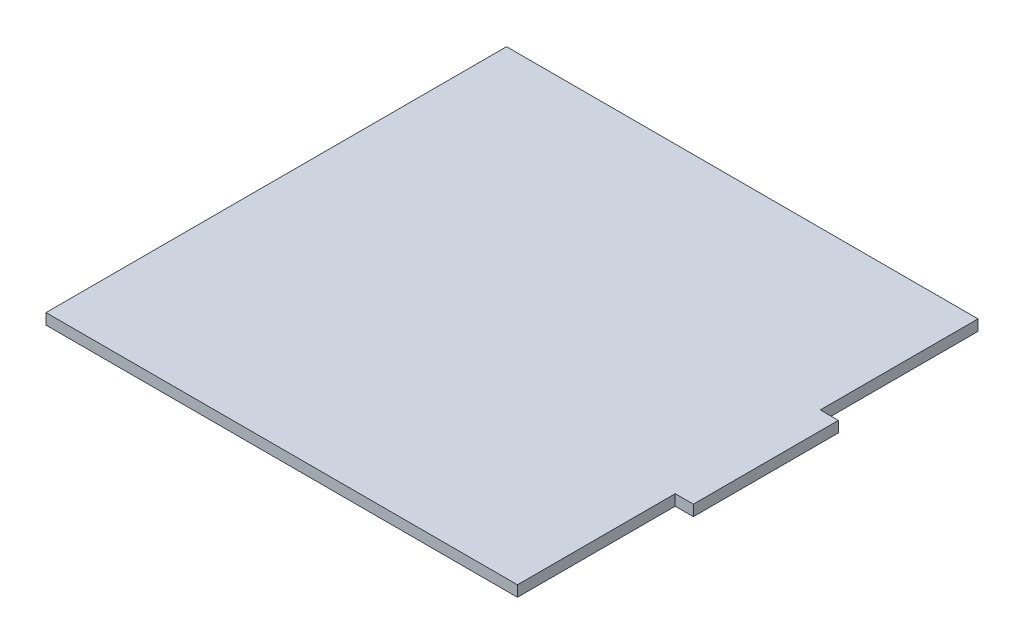
ISO-10303-21;
HEADER;
FILE_DESCRIPTION(('STEP AP214'),'2;1');
FILE_NAME('part.step','',(''),(''),'','','');
FILE_SCHEMA(('AUTOMOTIVE_DESIGN { 1 0 10303 214 1 1 1 1 }'));
ENDSEC;
DATA;
#1=APPLICATION_CONTEXT('core data for automotive mechanical design processes');
#2=APPLICATION_PROTOCOL_DEFINITION('international standard','automotive_design',2000,#1);
#3=PRODUCT_CONTEXT('',#1,'mechanical');
#4=PRODUCT('Part','Part','',(#3));
#5=PRODUCT_RELATED_PRODUCT_CATEGORY('part','',(#4));
#6=PRODUCT_DEFINITION_FORMATION('','',#4);
#7=PRODUCT_DEFINITION_CONTEXT('part definition',#1,'design');
#8=PRODUCT_DEFINITION('design','',#6,#7);
#9=PRODUCT_DEFINITION_SHAPE('','',#8);
#10=(LENGTH_UNIT() NAMED_UNIT(*) SI_UNIT(.MILLI.,.METRE.));
#11=(NAMED_UNIT(*) PLANE_ANGLE_UNIT() SI_UNIT($,.RADIAN.));
#12=(NAMED_UNIT(*) SI_UNIT($,.STERADIAN.) SOLID_ANGLE_UNIT());
#13=UNCERTAINTY_MEASURE_WITH_UNIT(LENGTH_MEASURE(1.E-05),#10,'distance_accuracy_value','');
#14=(GEOMETRIC_REPRESENTATION_CONTEXT(3) GLOBAL_UNCERTAINTY_ASSIGNED_CONTEXT((#13)) GLOBAL_UNIT_ASSIGNED_CONTEXT((#10,
#11,#12)) REPRESENTATION_CONTEXT('',''));
#15=CARTESIAN_POINT('',(0.,0.,0.));
#16=DIRECTION('',(0.,0.,1.));
#17=DIRECTION('',(1.,0.,0.));
#18=AXIS2_PLACEMENT_3D('',#15,#16,#17);
#19=CARTESIAN_POINT('',(65.,3.,20.));
#20=DIRECTION('',(-1.,0.,0.));
#21=DIRECTION('',(0.,0.,1.));
#22=AXIS2_PLACEMENT_3D('',#19,#20,#21);
#23=PLANE('',#22);
#24=DIRECTION('',(0.,0.,-1.));
#25=VECTOR('',#24,1.);
#26=CARTESIAN_POINT('',(65.,0.,20.));
#27=LINE('',#26,#25);
#28=CARTESIAN_POINT('',(65.,0.,63.5));
#29=VERTEX_POINT('',#28);
#30=CARTESIAN_POINT('',(65.,0.,20.));
#31=VERTEX_POINT('',#30);
#32=EDGE_CURVE('E140',#29,#31,#27,.T.);
#33=ORIENTED_EDGE('',*,*,#32,.T.);
#34=DIRECTION('',(0.,-1.,0.));
#35=VECTOR('',#34,1.);
#36=CARTESIAN_POINT('',(65.,3.,20.));
#37=LINE('',#36,#35);
#38=CARTESIAN_POINT('',(65.,3.,20.));
#39=VERTEX_POINT('',#38);
#40=EDGE_CURVE('E11',#39,#31,#37,.T.);
#41=ORIENTED_EDGE('',*,*,#40,.F.);
#42=DIRECTION('',(0.,0.,-1.));
#43=VECTOR('',#42,1.);
#44=CARTESIAN_POINT('',(65.,3.,20.));
#45=LINE('',#44,#43);
#46=CARTESIAN_POINT('',(65.,3.,63.5));
#47=VERTEX_POINT('',#46);
#48=EDGE_CURVE('E162',#47,#39,#45,.T.);
#49=ORIENTED_EDGE('',*,*,#48,.F.);
#50=DIRECTION('',(0.,-1.,0.));
#51=VECTOR('',#50,1.);
#52=CARTESIAN_POINT('',(65.,3.,63.5));
#53=LINE('',#52,#51);
#54=EDGE_CURVE('E136',#47,#29,#53,.T.);
#55=ORIENTED_EDGE('',*,*,#54,.T.);
#56=EDGE_LOOP('',(#33,#41,#49,#55));
#57=FACE_BOUND('',#56,.T.);
#58=ADVANCED_FACE('F39',(#57),#23,.F.);
#59=CARTESIAN_POINT('',(70.,3.,20.));
#60=DIRECTION('',(0.,0.,-1.));
#61=DIRECTION('',(-1.,0.,0.));
#62=AXIS2_PLACEMENT_3D('',#59,#60,#61);
#63=PLANE('',#62);
#64=DIRECTION('',(1.,0.,0.));
#65=VECTOR('',#64,1.);
#66=CARTESIAN_POINT('',(70.,0.,20.));
#67=LINE('',#66,#65);
#68=CARTESIAN_POINT('',(70.,0.,20.));
#69=VERTEX_POINT('',#68);
#70=EDGE_CURVE('E144',#31,#69,#67,.T.);
#71=ORIENTED_EDGE('',*,*,#70,.T.);
#72=DIRECTION('',(0.,-1.,0.));
#73=VECTOR('',#72,1.);
#74=CARTESIAN_POINT('',(70.,3.,20.));
#75=LINE('',#74,#73);
#76=CARTESIAN_POINT('',(70.,3.,20.));
#77=VERTEX_POINT('',#76);
#78=EDGE_CURVE('E48',#77,#69,#75,.T.);
#79=ORIENTED_EDGE('',*,*,#78,.F.);
#80=DIRECTION('',(1.,0.,0.));
#81=VECTOR('',#80,1.);
#82=CARTESIAN_POINT('',(70.,3.,20.));
#83=LINE('',#82,#81);
#84=EDGE_CURVE('E99',#39,#77,#83,.T.);
#85=ORIENTED_EDGE('',*,*,#84,.F.);
#86=ORIENTED_EDGE('',*,*,#40,.T.);
#87=EDGE_LOOP('',(#71,#79,#85,#86));
#88=FACE_BOUND('',#87,.T.);
#89=ADVANCED_FACE('F208',(#88),#63,.F.);
#90=CARTESIAN_POINT('',(70.,3.,-20.));
#91=DIRECTION('',(-1.,0.,0.));
#92=DIRECTION('',(0.,0.,1.));
#93=AXIS2_PLACEMENT_3D('',#90,#91,#92);
#94=PLANE('',#93);
#95=DIRECTION('',(0.,0.,-1.));
#96=VECTOR('',#95,1.);
#97=CARTESIAN_POINT('',(70.,0.,-20.));
#98=LINE('',#97,#96);
#99=CARTESIAN_POINT('',(70.,0.,-20.));
#100=VERTEX_POINT('',#99);
#101=EDGE_CURVE('E147',#69,#100,#98,.T.);
#102=ORIENTED_EDGE('',*,*,#101,.T.);
#103=DIRECTION('',(0.,-1.,0.));
#104=VECTOR('',#103,1.);
#105=CARTESIAN_POINT('',(70.,3.,-20.));
#106=LINE('',#105,#104);
#107=CARTESIAN_POINT('',(70.,3.,-20.));
#108=VERTEX_POINT('',#107);
#109=EDGE_CURVE('E173',#108,#100,#106,.T.);
#110=ORIENTED_EDGE('',*,*,#109,.F.);
#111=DIRECTION('',(0.,0.,-1.));
#112=VECTOR('',#111,1.);
#113=CARTESIAN_POINT('',(70.,3.,-20.));
#114=LINE('',#113,#112);
#115=EDGE_CURVE('E183',#77,#108,#114,.T.);
#116=ORIENTED_EDGE('',*,*,#115,.F.);
#117=ORIENTED_EDGE('',*,*,#78,.T.);
#118=EDGE_LOOP('',(#102,#110,#116,#117));
#119=FACE_BOUND('',#118,.T.);
#120=ADVANCED_FACE('F181',(#119),#94,.F.);
#121=CARTESIAN_POINT('',(65.,3.,-20.));
#122=DIRECTION('',(0.,0.,1.));
#123=DIRECTION('',(1.,0.,0.));
#124=AXIS2_PLACEMENT_3D('',#121,#122,#123);
#125=PLANE('',#124);
#126=DIRECTION('',(-1.,0.,0.));
#127=VECTOR('',#126,1.);
#128=CARTESIAN_POINT('',(65.,0.,-20.));
#129=LINE('',#128,#127);
#130=CARTESIAN_POINT('',(65.,0.,-20.));
#131=VERTEX_POINT('',#130);
#132=EDGE_CURVE('E150',#100,#131,#129,.T.);
#133=ORIENTED_EDGE('',*,*,#132,.T.);
#134=DIRECTION('',(0.,-1.,0.));
#135=VECTOR('',#134,1.);
#136=CARTESIAN_POINT('',(65.,3.,-20.));
#137=LINE('',#136,#135);
#138=CARTESIAN_POINT('',(65.,3.,-20.));
#139=VERTEX_POINT('',#138);
#140=EDGE_CURVE('E169',#139,#131,#137,.T.);
#141=ORIENTED_EDGE('',*,*,#140,.F.);
#142=DIRECTION('',(-1.,0.,0.));
#143=VECTOR('',#142,1.);
#144=CARTESIAN_POINT('',(65.,3.,-20.));
#145=LINE('',#144,#143);
#146=EDGE_CURVE('E196',#108,#139,#145,.T.);
#147=ORIENTED_EDGE('',*,*,#146,.F.);
#148=ORIENTED_EDGE('',*,*,#109,.T.);
#149=EDGE_LOOP('',(#133,#141,#147,#148));
#150=FACE_BOUND('',#149,.T.);
#151=ADVANCED_FACE('F191',(#150),#125,.F.);
#152=CARTESIAN_POINT('',(65.,3.,-63.5));
#153=DIRECTION('',(-1.,0.,0.));
#154=DIRECTION('',(0.,0.,1.));
#155=AXIS2_PLACEMENT_3D('',#152,#153,#154);
#156=PLANE('',#155);
#157=DIRECTION('',(0.,0.,-1.));
#158=VECTOR('',#157,1.);
#159=CARTESIAN_POINT('',(65.,0.,-63.5));
#160=LINE('',#159,#158);
#161=CARTESIAN_POINT('',(65.,0.,-63.5));
#162=VERTEX_POINT('',#161);
#163=EDGE_CURVE('E153',#131,#162,#160,.T.);
#164=ORIENTED_EDGE('',*,*,#163,.T.);
#165=DIRECTION('',(0.,-1.,0.));
#166=VECTOR('',#165,1.);
#167=CARTESIAN_POINT('',(65.,3.,-63.5));
#168=LINE('',#167,#166);
#169=CARTESIAN_POINT('',(65.,3.,-63.5));
#170=VERTEX_POINT('',#169);
#171=EDGE_CURVE('E129',#170,#162,#168,.T.);
#172=ORIENTED_EDGE('',*,*,#171,.F.);
#173=DIRECTION('',(0.,0.,-1.));
#174=VECTOR('',#173,1.);
#175=CARTESIAN_POINT('',(65.,3.,-63.5));
#176=LINE('',#175,#174);
#177=EDGE_CURVE('E118',#139,#170,#176,.T.);
#178=ORIENTED_EDGE('',*,*,#177,.F.);
#179=ORIENTED_EDGE('',*,*,#140,.T.);
#180=EDGE_LOOP('',(#164,#172,#178,#179));
#181=FACE_BOUND('',#180,.T.);
#182=ADVANCED_FACE('F194',(#181),#156,.F.);
#183=CARTESIAN_POINT('',(-65.,3.,-63.5));
#184=DIRECTION('',(0.,0.,1.));
#185=DIRECTION('',(1.,0.,0.));
#186=AXIS2_PLACEMENT_3D('',#183,#184,#185);
#187=PLANE('',#186);
#188=DIRECTION('',(-1.,0.,0.));
#189=VECTOR('',#188,1.);
#190=CARTESIAN_POINT('',(-65.,0.,-63.5));
#191=LINE('',#190,#189);
#192=CARTESIAN_POINT('',(-65.,0.,-63.5));
#193=VERTEX_POINT('',#192);
#194=EDGE_CURVE('E127',#162,#193,#191,.T.);
#195=ORIENTED_EDGE('',*,*,#194,.T.);
#196=DIRECTION('',(0.,-1.,0.));
#197=VECTOR('',#196,1.);
#198=CARTESIAN_POINT('',(-65.,3.,-63.5));
#199=LINE('',#198,#197);
#200=CARTESIAN_POINT('',(-65.,3.,-63.5));
#201=VERTEX_POINT('',#200);
#202=EDGE_CURVE('E124',#201,#193,#199,.T.);
#203=ORIENTED_EDGE('',*,*,#202,.F.);
#204=DIRECTION('',(-1.,0.,0.));
#205=VECTOR('',#204,1.);
#206=CARTESIAN_POINT('',(-65.,3.,-63.5));
#207=LINE('',#206,#205);
#208=EDGE_CURVE('E112',#170,#201,#207,.T.);
#209=ORIENTED_EDGE('',*,*,#208,.F.);
#210=ORIENTED_EDGE('',*,*,#171,.T.);
#211=EDGE_LOOP('',(#195,#203,#209,#210));
#212=FACE_BOUND('',#211,.T.);
#213=ADVANCED_FACE('F125',(#212),#187,.F.);
#214=CARTESIAN_POINT('',(-65.,3.,-63.5));
#215=DIRECTION('',(1.,0.,0.));
#216=DIRECTION('',(0.,0.,-1.));
#217=AXIS2_PLACEMENT_3D('',#214,#215,#216);
#218=PLANE('',#217);
#219=DIRECTION('',(0.,0.,1.));
#220=VECTOR('',#219,1.);
#221=CARTESIAN_POINT('',(-65.,0.,-63.5));
#222=LINE('',#221,#220);
#223=CARTESIAN_POINT('',(-65.,0.,63.5));
#224=VERTEX_POINT('',#223);
#225=EDGE_CURVE('E85',#193,#224,#222,.T.);
#226=ORIENTED_EDGE('',*,*,#225,.T.);
#227=DIRECTION('',(0.,-1.,0.));
#228=VECTOR('',#227,1.);
#229=CARTESIAN_POINT('',(-65.,3.,63.5));
#230=LINE('',#229,#228);
#231=CARTESIAN_POINT('',(-65.,3.,63.5));
#232=VERTEX_POINT('',#231);
#233=EDGE_CURVE('E130',#232,#224,#230,.T.);
#234=ORIENTED_EDGE('',*,*,#233,.F.);
#235=DIRECTION('',(0.,0.,1.));
#236=VECTOR('',#235,1.);
#237=CARTESIAN_POINT('',(-65.,3.,-63.5));
#238=LINE('',#237,#236);
#239=EDGE_CURVE('E116',#201,#232,#238,.T.);
#240=ORIENTED_EDGE('',*,*,#239,.F.);
#241=ORIENTED_EDGE('',*,*,#202,.T.);
#242=EDGE_LOOP('',(#226,#234,#240,#241));
#243=FACE_BOUND('',#242,.T.);
#244=ADVANCED_FACE('F132',(#243),#218,.F.);
#245=CARTESIAN_POINT('',(-65.,3.,63.5));
#246=DIRECTION('',(0.,0.,-1.));
#247=DIRECTION('',(-1.,0.,0.));
#248=AXIS2_PLACEMENT_3D('',#245,#246,#247);
#249=PLANE('',#248);
#250=DIRECTION('',(1.,0.,0.));
#251=VECTOR('',#250,1.);
#252=CARTESIAN_POINT('',(-65.,0.,63.5));
#253=LINE('',#252,#251);
#254=EDGE_CURVE('E91',#224,#29,#253,.T.);
#255=ORIENTED_EDGE('',*,*,#254,.T.);
#256=ORIENTED_EDGE('',*,*,#54,.F.);
#257=DIRECTION('',(1.,0.,0.));
#258=VECTOR('',#257,1.);
#259=CARTESIAN_POINT('',(-65.,3.,63.5));
#260=LINE('',#259,#258);
#261=EDGE_CURVE('E56',#232,#47,#260,.T.);
#262=ORIENTED_EDGE('',*,*,#261,.F.);
#263=ORIENTED_EDGE('',*,*,#233,.T.);
#264=EDGE_LOOP('',(#255,#256,#262,#263));
#265=FACE_BOUND('',#264,.T.);
#266=ADVANCED_FACE('F224',(#265),#249,.F.);
#267=CARTESIAN_POINT('',(0.,3.,0.));
#268=DIRECTION('',(0.,1.,0.));
#269=DIRECTION('',(0.,0.,1.));
#270=AXIS2_PLACEMENT_3D('',#267,#268,#269);
#271=PLANE('',#270);
#272=ORIENTED_EDGE('',*,*,#48,.T.);
#273=ORIENTED_EDGE('',*,*,#84,.T.);
#274=ORIENTED_EDGE('',*,*,#115,.T.);
#275=ORIENTED_EDGE('',*,*,#146,.T.);
#276=ORIENTED_EDGE('',*,*,#177,.T.);
#277=ORIENTED_EDGE('',*,*,#208,.T.);
#278=ORIENTED_EDGE('',*,*,#239,.T.);
#279=ORIENTED_EDGE('',*,*,#261,.T.);
#280=EDGE_LOOP('',(#272,#273,#274,#275,#276,#277,#278,#279));
#281=FACE_BOUND('',#280,.T.);
#282=ADVANCED_FACE('F114',(#281),#271,.T.);
#283=CARTESIAN_POINT('',(0.,0.,0.));
#284=DIRECTION('',(0.,1.,0.));
#285=DIRECTION('',(0.,0.,1.));
#286=AXIS2_PLACEMENT_3D('',#283,#284,#285);
#287=PLANE('',#286);
#288=ORIENTED_EDGE('',*,*,#32,.F.);
#289=ORIENTED_EDGE('',*,*,#254,.F.);
#290=ORIENTED_EDGE('',*,*,#225,.F.);
#291=ORIENTED_EDGE('',*,*,#194,.F.);
#292=ORIENTED_EDGE('',*,*,#163,.F.);
#293=ORIENTED_EDGE('',*,*,#132,.F.);
#294=ORIENTED_EDGE('',*,*,#101,.F.);
#295=ORIENTED_EDGE('',*,*,#70,.F.);
#296=EDGE_LOOP('',(#288,#289,#290,#291,#292,#293,#294,#295));
#297=FACE_BOUND('',#296,.T.);
#298=ADVANCED_FACE('F187',(#297),#287,.F.);
#299=CLOSED_SHELL('',(#58,#89,#120,#151,#182,#213,#244,#266,#282,#298));
#300=MANIFOLD_SOLID_BREP('B2',#299);
#301=ADVANCED_BREP_SHAPE_REPRESENTATION('',(#18,#300),#14);
#302=SHAPE_DEFINITION_REPRESENTATION(#9,#301);
ENDSEC;
END-ISO-10303-21;
